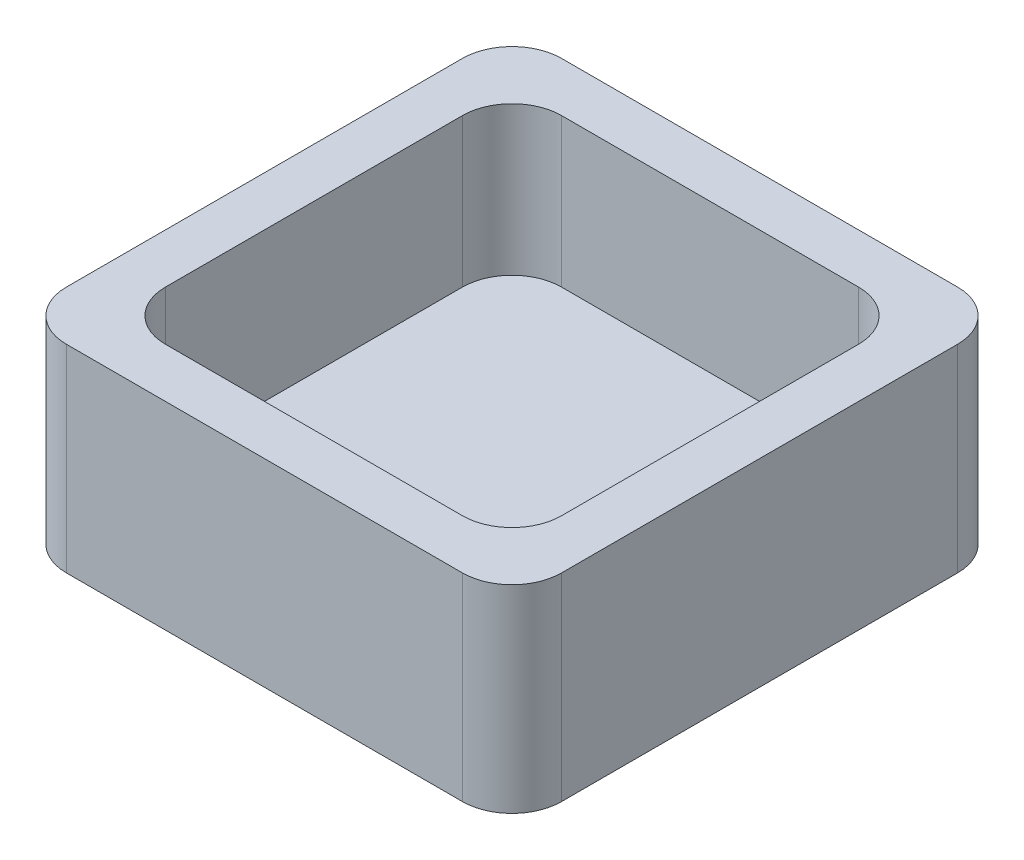
ISO-10303-21;
HEADER;
FILE_DESCRIPTION(('STEP AP214'),'2;1');
FILE_NAME('part.step','',(''),(''),'','','');
FILE_SCHEMA(('AUTOMOTIVE_DESIGN { 1 0 10303 214 1 1 1 1 }'));
ENDSEC;
DATA;
#1=APPLICATION_CONTEXT('core data for automotive mechanical design processes');
#2=APPLICATION_PROTOCOL_DEFINITION('international standard','automotive_design',2000,#1);
#3=PRODUCT_CONTEXT('',#1,'mechanical');
#4=PRODUCT('Part','Part','',(#3));
#5=PRODUCT_RELATED_PRODUCT_CATEGORY('part','',(#4));
#6=PRODUCT_DEFINITION_FORMATION('','',#4);
#7=PRODUCT_DEFINITION_CONTEXT('part definition',#1,'design');
#8=PRODUCT_DEFINITION('design','',#6,#7);
#9=PRODUCT_DEFINITION_SHAPE('','',#8);
#10=(LENGTH_UNIT() NAMED_UNIT(*) SI_UNIT(.MILLI.,.METRE.));
#11=(NAMED_UNIT(*) PLANE_ANGLE_UNIT() SI_UNIT($,.RADIAN.));
#12=(NAMED_UNIT(*) SI_UNIT($,.STERADIAN.) SOLID_ANGLE_UNIT());
#13=UNCERTAINTY_MEASURE_WITH_UNIT(LENGTH_MEASURE(1.E-05),#10,'distance_accuracy_value','');
#14=(GEOMETRIC_REPRESENTATION_CONTEXT(3) GLOBAL_UNCERTAINTY_ASSIGNED_CONTEXT((#13)) GLOBAL_UNIT_ASSIGNED_CONTEXT((#10,
#11,#12)) REPRESENTATION_CONTEXT('',''));
#15=CARTESIAN_POINT('',(0.,0.,0.));
#16=DIRECTION('',(0.,0.,1.));
#17=DIRECTION('',(1.,0.,0.));
#18=AXIS2_PLACEMENT_3D('',#15,#16,#17);
#19=CARTESIAN_POINT('',(-50.,40.,-50.));
#20=DIRECTION('',(1.,0.,0.));
#21=DIRECTION('',(0.,0.,-1.));
#22=AXIS2_PLACEMENT_3D('',#19,#20,#21);
#23=PLANE('',#22);
#24=DIRECTION('',(0.,0.,1.));
#25=VECTOR('',#24,1.);
#26=CARTESIAN_POINT('',(-50.,40.,-50.));
#27=LINE('',#26,#25);
#28=CARTESIAN_POINT('',(-50.,40.,-40.));
#29=VERTEX_POINT('',#28);
#30=CARTESIAN_POINT('',(-50.,40.,40.));
#31=VERTEX_POINT('',#30);
#32=EDGE_CURVE('E244',#29,#31,#27,.T.);
#33=ORIENTED_EDGE('',*,*,#32,.F.);
#34=DIRECTION('',(0.,-1.,0.));
#35=VECTOR('',#34,1.);
#36=CARTESIAN_POINT('',(-50.,40.,-40.));
#37=LINE('',#36,#35);
#38=CARTESIAN_POINT('',(-50.,0.,-40.));
#39=VERTEX_POINT('',#38);
#40=EDGE_CURVE('E287',#29,#39,#37,.T.);
#41=ORIENTED_EDGE('',*,*,#40,.T.);
#42=DIRECTION('',(0.,0.,1.));
#43=VECTOR('',#42,1.);
#44=CARTESIAN_POINT('',(-50.,0.,-50.));
#45=LINE('',#44,#43);
#46=CARTESIAN_POINT('',(-50.,0.,40.));
#47=VERTEX_POINT('',#46);
#48=EDGE_CURVE('E246',#39,#47,#45,.T.);
#49=ORIENTED_EDGE('',*,*,#48,.T.);
#50=DIRECTION('',(0.,-1.,0.));
#51=VECTOR('',#50,1.);
#52=CARTESIAN_POINT('',(-50.,40.,40.));
#53=LINE('',#52,#51);
#54=EDGE_CURVE('E284',#47,#31,#53,.F.);
#55=ORIENTED_EDGE('',*,*,#54,.T.);
#56=EDGE_LOOP('',(#33,#41,#49,#55));
#57=FACE_BOUND('',#56,.T.);
#58=ADVANCED_FACE('F45',(#57),#23,.F.);
#59=CARTESIAN_POINT('',(50.,40.,50.));
#60=DIRECTION('',(0.,0.,-1.));
#61=DIRECTION('',(-1.,0.,0.));
#62=AXIS2_PLACEMENT_3D('',#59,#60,#61);
#63=PLANE('',#62);
#64=DIRECTION('',(1.,0.,0.));
#65=VECTOR('',#64,1.);
#66=CARTESIAN_POINT('',(50.,0.,50.));
#67=LINE('',#66,#65);
#68=CARTESIAN_POINT('',(-40.,0.,50.));
#69=VERTEX_POINT('',#68);
#70=CARTESIAN_POINT('',(40.,0.,50.));
#71=VERTEX_POINT('',#70);
#72=EDGE_CURVE('E239',#69,#71,#67,.T.);
#73=ORIENTED_EDGE('',*,*,#72,.T.);
#74=DIRECTION('',(0.,-1.,0.));
#75=VECTOR('',#74,1.);
#76=CARTESIAN_POINT('',(40.,40.,50.));
#77=LINE('',#76,#75);
#78=CARTESIAN_POINT('',(40.,40.,50.));
#79=VERTEX_POINT('',#78);
#80=EDGE_CURVE('E214',#71,#79,#77,.F.);
#81=ORIENTED_EDGE('',*,*,#80,.T.);
#82=DIRECTION('',(1.,0.,0.));
#83=VECTOR('',#82,1.);
#84=CARTESIAN_POINT('',(50.,40.,50.));
#85=LINE('',#84,#83);
#86=CARTESIAN_POINT('',(-40.,40.,50.));
#87=VERTEX_POINT('',#86);
#88=EDGE_CURVE('E460',#87,#79,#85,.T.);
#89=ORIENTED_EDGE('',*,*,#88,.F.);
#90=DIRECTION('',(0.,-1.,0.));
#91=VECTOR('',#90,1.);
#92=CARTESIAN_POINT('',(-40.,40.,50.));
#93=LINE('',#92,#91);
#94=EDGE_CURVE('E220',#87,#69,#93,.T.);
#95=ORIENTED_EDGE('',*,*,#94,.T.);
#96=EDGE_LOOP('',(#73,#81,#89,#95));
#97=FACE_BOUND('',#96,.T.);
#98=ADVANCED_FACE('F483',(#97),#63,.F.);
#99=CARTESIAN_POINT('',(50.,40.,-50.));
#100=DIRECTION('',(-1.,0.,0.));
#101=DIRECTION('',(0.,0.,1.));
#102=AXIS2_PLACEMENT_3D('',#99,#100,#101);
#103=PLANE('',#102);
#104=DIRECTION('',(0.,0.,-1.));
#105=VECTOR('',#104,1.);
#106=CARTESIAN_POINT('',(50.,40.,-50.));
#107=LINE('',#106,#105);
#108=CARTESIAN_POINT('',(50.,40.,40.));
#109=VERTEX_POINT('',#108);
#110=CARTESIAN_POINT('',(50.,40.,-40.));
#111=VERTEX_POINT('',#110);
#112=EDGE_CURVE('E230',#109,#111,#107,.T.);
#113=ORIENTED_EDGE('',*,*,#112,.F.);
#114=DIRECTION('',(0.,-1.,0.));
#115=VECTOR('',#114,1.);
#116=CARTESIAN_POINT('',(50.,40.,40.));
#117=LINE('',#116,#115);
#118=CARTESIAN_POINT('',(50.,0.,40.));
#119=VERTEX_POINT('',#118);
#120=EDGE_CURVE('E213',#109,#119,#117,.T.);
#121=ORIENTED_EDGE('',*,*,#120,.T.);
#122=DIRECTION('',(0.,0.,-1.));
#123=VECTOR('',#122,1.);
#124=CARTESIAN_POINT('',(50.,0.,-50.));
#125=LINE('',#124,#123);
#126=CARTESIAN_POINT('',(50.,0.,-40.));
#127=VERTEX_POINT('',#126);
#128=EDGE_CURVE('E227',#119,#127,#125,.T.);
#129=ORIENTED_EDGE('',*,*,#128,.T.);
#130=DIRECTION('',(0.,-1.,0.));
#131=VECTOR('',#130,1.);
#132=CARTESIAN_POINT('',(50.,40.,-40.));
#133=LINE('',#132,#131);
#134=EDGE_CURVE('E233',#127,#111,#133,.F.);
#135=ORIENTED_EDGE('',*,*,#134,.T.);
#136=EDGE_LOOP('',(#113,#121,#129,#135));
#137=FACE_BOUND('',#136,.T.);
#138=ADVANCED_FACE('F226',(#137),#103,.F.);
#139=CARTESIAN_POINT('',(50.,40.,-50.));
#140=DIRECTION('',(0.,0.,1.));
#141=DIRECTION('',(1.,0.,0.));
#142=AXIS2_PLACEMENT_3D('',#139,#140,#141);
#143=PLANE('',#142);
#144=DIRECTION('',(-1.,0.,0.));
#145=VECTOR('',#144,1.);
#146=CARTESIAN_POINT('',(50.,40.,-50.));
#147=LINE('',#146,#145);
#148=CARTESIAN_POINT('',(40.,40.,-50.));
#149=VERTEX_POINT('',#148);
#150=CARTESIAN_POINT('',(-40.,40.,-50.));
#151=VERTEX_POINT('',#150);
#152=EDGE_CURVE('E251',#149,#151,#147,.T.);
#153=ORIENTED_EDGE('',*,*,#152,.F.);
#154=DIRECTION('',(0.,-1.,0.));
#155=VECTOR('',#154,1.);
#156=CARTESIAN_POINT('',(40.,40.,-50.));
#157=LINE('',#156,#155);
#158=CARTESIAN_POINT('',(40.,0.,-50.));
#159=VERTEX_POINT('',#158);
#160=EDGE_CURVE('E280',#149,#159,#157,.T.);
#161=ORIENTED_EDGE('',*,*,#160,.T.);
#162=DIRECTION('',(-1.,0.,0.));
#163=VECTOR('',#162,1.);
#164=CARTESIAN_POINT('',(50.,0.,-50.));
#165=LINE('',#164,#163);
#166=CARTESIAN_POINT('',(-40.,0.,-50.));
#167=VERTEX_POINT('',#166);
#168=EDGE_CURVE('E238',#159,#167,#165,.T.);
#169=ORIENTED_EDGE('',*,*,#168,.T.);
#170=DIRECTION('',(0.,-1.,0.));
#171=VECTOR('',#170,1.);
#172=CARTESIAN_POINT('',(-40.,40.,-50.));
#173=LINE('',#172,#171);
#174=EDGE_CURVE('E277',#167,#151,#173,.F.);
#175=ORIENTED_EDGE('',*,*,#174,.T.);
#176=EDGE_LOOP('',(#153,#161,#169,#175));
#177=FACE_BOUND('',#176,.T.);
#178=ADVANCED_FACE('F490',(#177),#143,.F.);
#179=CARTESIAN_POINT('',(0.,40.,0.));
#180=DIRECTION('',(0.,-1.,0.));
#181=DIRECTION('',(0.,0.,-1.));
#182=AXIS2_PLACEMENT_3D('',#179,#180,#181);
#183=PLANE('',#182);
#184=DIRECTION('',(1.,0.,0.));
#185=VECTOR('',#184,1.);
#186=CARTESIAN_POINT('',(40.,40.,40.));
#187=LINE('',#186,#185);
#188=CARTESIAN_POINT('',(-30.,40.,40.));
#189=VERTEX_POINT('',#188);
#190=CARTESIAN_POINT('',(30.,40.,40.));
#191=VERTEX_POINT('',#190);
#192=EDGE_CURVE('E446',#189,#191,#187,.T.);
#193=ORIENTED_EDGE('',*,*,#192,.F.);
#194=CARTESIAN_POINT('',(-30.,40.,30.));
#195=DIRECTION('',(0.,-1.,0.));
#196=DIRECTION('',(0.,0.,-1.));
#197=AXIS2_PLACEMENT_3D('',#194,#195,#196);
#198=CIRCLE('',#197,10.);
#199=CARTESIAN_POINT('',(-40.,40.,30.));
#200=VERTEX_POINT('',#199);
#201=EDGE_CURVE('E340',#189,#200,#198,.T.);
#202=ORIENTED_EDGE('',*,*,#201,.T.);
#203=DIRECTION('',(0.,0.,1.));
#204=VECTOR('',#203,1.);
#205=CARTESIAN_POINT('',(-40.,40.,-40.));
#206=LINE('',#205,#204);
#207=CARTESIAN_POINT('',(-40.,40.,-30.));
#208=VERTEX_POINT('',#207);
#209=EDGE_CURVE('E425',#208,#200,#206,.T.);
#210=ORIENTED_EDGE('',*,*,#209,.F.);
#211=CARTESIAN_POINT('',(-30.,40.,-30.));
#212=DIRECTION('',(0.,-1.,0.));
#213=DIRECTION('',(0.,0.,-1.));
#214=AXIS2_PLACEMENT_3D('',#211,#212,#213);
#215=CIRCLE('',#214,10.);
#216=CARTESIAN_POINT('',(-30.,40.,-40.));
#217=VERTEX_POINT('',#216);
#218=EDGE_CURVE('E337',#208,#217,#215,.T.);
#219=ORIENTED_EDGE('',*,*,#218,.T.);
#220=DIRECTION('',(-1.,0.,0.));
#221=VECTOR('',#220,1.);
#222=CARTESIAN_POINT('',(40.,40.,-40.));
#223=LINE('',#222,#221);
#224=CARTESIAN_POINT('',(30.,40.,-40.));
#225=VERTEX_POINT('',#224);
#226=EDGE_CURVE('E431',#225,#217,#223,.T.);
#227=ORIENTED_EDGE('',*,*,#226,.F.);
#228=CARTESIAN_POINT('',(30.,40.,-30.));
#229=DIRECTION('',(0.,-1.,0.));
#230=DIRECTION('',(0.,0.,-1.));
#231=AXIS2_PLACEMENT_3D('',#228,#229,#230);
#232=CIRCLE('',#231,10.);
#233=CARTESIAN_POINT('',(40.,40.,-30.));
#234=VERTEX_POINT('',#233);
#235=EDGE_CURVE('E334',#225,#234,#232,.T.);
#236=ORIENTED_EDGE('',*,*,#235,.T.);
#237=DIRECTION('',(0.,0.,-1.));
#238=VECTOR('',#237,1.);
#239=CARTESIAN_POINT('',(40.,40.,-40.));
#240=LINE('',#239,#238);
#241=CARTESIAN_POINT('',(40.,40.,30.));
#242=VERTEX_POINT('',#241);
#243=EDGE_CURVE('E450',#242,#234,#240,.T.);
#244=ORIENTED_EDGE('',*,*,#243,.F.);
#245=CARTESIAN_POINT('',(30.,40.,30.));
#246=DIRECTION('',(0.,-1.,0.));
#247=DIRECTION('',(0.,0.,-1.));
#248=AXIS2_PLACEMENT_3D('',#245,#246,#247);
#249=CIRCLE('',#248,10.);
#250=EDGE_CURVE('E331',#242,#191,#249,.T.);
#251=ORIENTED_EDGE('',*,*,#250,.T.);
#252=EDGE_LOOP('',(#193,#202,#210,#219,#227,#236,#244,#251));
#253=FACE_BOUND('',#252,.T.);
#254=ORIENTED_EDGE('',*,*,#88,.T.);
#255=CARTESIAN_POINT('',(40.,40.,40.));
#256=DIRECTION('',(0.,-1.,0.));
#257=DIRECTION('',(0.,0.,-1.));
#258=AXIS2_PLACEMENT_3D('',#255,#256,#257);
#259=CIRCLE('',#258,10.);
#260=EDGE_CURVE('E274',#79,#109,#259,.F.);
#261=ORIENTED_EDGE('',*,*,#260,.T.);
#262=ORIENTED_EDGE('',*,*,#112,.T.);
#263=CARTESIAN_POINT('',(40.,40.,-40.));
#264=DIRECTION('',(0.,-1.,0.));
#265=DIRECTION('',(0.,0.,-1.));
#266=AXIS2_PLACEMENT_3D('',#263,#264,#265);
#267=CIRCLE('',#266,10.);
#268=EDGE_CURVE('E271',#111,#149,#267,.F.);
#269=ORIENTED_EDGE('',*,*,#268,.T.);
#270=ORIENTED_EDGE('',*,*,#152,.T.);
#271=CARTESIAN_POINT('',(-40.,40.,-40.));
#272=DIRECTION('',(0.,-1.,0.));
#273=DIRECTION('',(0.,0.,-1.));
#274=AXIS2_PLACEMENT_3D('',#271,#272,#273);
#275=CIRCLE('',#274,10.);
#276=EDGE_CURVE('E268',#151,#29,#275,.F.);
#277=ORIENTED_EDGE('',*,*,#276,.T.);
#278=ORIENTED_EDGE('',*,*,#32,.T.);
#279=CARTESIAN_POINT('',(-40.,40.,40.));
#280=DIRECTION('',(0.,-1.,0.));
#281=DIRECTION('',(0.,0.,-1.));
#282=AXIS2_PLACEMENT_3D('',#279,#280,#281);
#283=CIRCLE('',#282,10.);
#284=EDGE_CURVE('E265',#31,#87,#283,.F.);
#285=ORIENTED_EDGE('',*,*,#284,.T.);
#286=EDGE_LOOP('',(#254,#261,#262,#269,#270,#277,#278,#285));
#287=FACE_BOUND('',#286,.T.);
#288=ADVANCED_FACE('F481',(#253,#287),#183,.F.);
#289=CARTESIAN_POINT('',(0.,0.,0.));
#290=DIRECTION('',(0.,-1.,0.));
#291=DIRECTION('',(0.,0.,-1.));
#292=AXIS2_PLACEMENT_3D('',#289,#290,#291);
#293=PLANE('',#292);
#294=DIRECTION('',(0.,0.,-1.));
#295=VECTOR('',#294,1.);
#296=CARTESIAN_POINT('',(-46.7082039324994,0.,33.));
#297=LINE('',#296,#295);
#298=CARTESIAN_POINT('',(-46.7082039324994,0.,-33.));
#299=VERTEX_POINT('',#298);
#300=CARTESIAN_POINT('',(-46.7082039324994,0.,33.));
#301=VERTEX_POINT('',#300);
#302=EDGE_CURVE('E356',#299,#301,#297,.F.);
#303=ORIENTED_EDGE('',*,*,#302,.T.);
#304=CARTESIAN_POINT('',(-33.,0.,33.));
#305=DIRECTION('',(0.,-1.,0.));
#306=DIRECTION('',(0.,0.,-1.));
#307=AXIS2_PLACEMENT_3D('',#304,#305,#306);
#308=CIRCLE('',#307,13.7082039324994);
#309=CARTESIAN_POINT('',(-33.,0.,46.7082039324994));
#310=VERTEX_POINT('',#309);
#311=EDGE_CURVE('E11',#301,#310,#308,.F.);
#312=ORIENTED_EDGE('',*,*,#311,.T.);
#313=DIRECTION('',(-1.,0.,0.));
#314=VECTOR('',#313,1.);
#315=CARTESIAN_POINT('',(33.,0.,46.7082039324994));
#316=LINE('',#315,#314);
#317=CARTESIAN_POINT('',(33.,0.,46.7082039324994));
#318=VERTEX_POINT('',#317);
#319=EDGE_CURVE('E55',#310,#318,#316,.F.);
#320=ORIENTED_EDGE('',*,*,#319,.T.);
#321=CARTESIAN_POINT('',(33.,0.,33.));
#322=DIRECTION('',(0.,-1.,0.));
#323=DIRECTION('',(0.,0.,-1.));
#324=AXIS2_PLACEMENT_3D('',#321,#322,#323);
#325=CIRCLE('',#324,13.7082039324994);
#326=CARTESIAN_POINT('',(46.7082039324994,0.,33.));
#327=VERTEX_POINT('',#326);
#328=EDGE_CURVE('E371',#318,#327,#325,.F.);
#329=ORIENTED_EDGE('',*,*,#328,.T.);
#330=DIRECTION('',(0.,0.,1.));
#331=VECTOR('',#330,1.);
#332=CARTESIAN_POINT('',(46.7082039324994,0.,-33.));
#333=LINE('',#332,#331);
#334=CARTESIAN_POINT('',(46.7082039324994,0.,-33.));
#335=VERTEX_POINT('',#334);
#336=EDGE_CURVE('E368',#327,#335,#333,.F.);
#337=ORIENTED_EDGE('',*,*,#336,.T.);
#338=CARTESIAN_POINT('',(33.,0.,-33.));
#339=DIRECTION('',(0.,-1.,0.));
#340=DIRECTION('',(0.,0.,-1.));
#341=AXIS2_PLACEMENT_3D('',#338,#339,#340);
#342=CIRCLE('',#341,13.7082039324994);
#343=CARTESIAN_POINT('',(33.,0.,-46.7082039324994));
#344=VERTEX_POINT('',#343);
#345=EDGE_CURVE('E365',#335,#344,#342,.F.);
#346=ORIENTED_EDGE('',*,*,#345,.T.);
#347=DIRECTION('',(1.,0.,0.));
#348=VECTOR('',#347,1.);
#349=CARTESIAN_POINT('',(-33.,0.,-46.7082039324994));
#350=LINE('',#349,#348);
#351=CARTESIAN_POINT('',(-33.,0.,-46.7082039324994));
#352=VERTEX_POINT('',#351);
#353=EDGE_CURVE('E362',#344,#352,#350,.F.);
#354=ORIENTED_EDGE('',*,*,#353,.T.);
#355=CARTESIAN_POINT('',(-33.,0.,-33.));
#356=DIRECTION('',(0.,-1.,0.));
#357=DIRECTION('',(0.,0.,-1.));
#358=AXIS2_PLACEMENT_3D('',#355,#356,#357);
#359=CIRCLE('',#358,13.7082039324994);
#360=EDGE_CURVE('E359',#352,#299,#359,.F.);
#361=ORIENTED_EDGE('',*,*,#360,.T.);
#362=EDGE_LOOP('',(#303,#312,#320,#329,#337,#346,#354,#361));
#363=FACE_BOUND('',#362,.T.);
#364=ORIENTED_EDGE('',*,*,#128,.F.);
#365=CARTESIAN_POINT('',(40.,0.,40.));
#366=DIRECTION('',(0.,-1.,0.));
#367=DIRECTION('',(0.,0.,-1.));
#368=AXIS2_PLACEMENT_3D('',#365,#366,#367);
#369=CIRCLE('',#368,10.);
#370=EDGE_CURVE('E209',#119,#71,#369,.T.);
#371=ORIENTED_EDGE('',*,*,#370,.T.);
#372=ORIENTED_EDGE('',*,*,#72,.F.);
#373=CARTESIAN_POINT('',(-40.,0.,40.));
#374=DIRECTION('',(0.,-1.,0.));
#375=DIRECTION('',(0.,0.,-1.));
#376=AXIS2_PLACEMENT_3D('',#373,#374,#375);
#377=CIRCLE('',#376,10.);
#378=EDGE_CURVE('E232',#69,#47,#377,.T.);
#379=ORIENTED_EDGE('',*,*,#378,.T.);
#380=ORIENTED_EDGE('',*,*,#48,.F.);
#381=CARTESIAN_POINT('',(-40.,0.,-40.));
#382=DIRECTION('',(0.,-1.,0.));
#383=DIRECTION('',(0.,0.,-1.));
#384=AXIS2_PLACEMENT_3D('',#381,#382,#383);
#385=CIRCLE('',#384,10.);
#386=EDGE_CURVE('E255',#39,#167,#385,.T.);
#387=ORIENTED_EDGE('',*,*,#386,.T.);
#388=ORIENTED_EDGE('',*,*,#168,.F.);
#389=CARTESIAN_POINT('',(40.,0.,-40.));
#390=DIRECTION('',(0.,-1.,0.));
#391=DIRECTION('',(0.,0.,-1.));
#392=AXIS2_PLACEMENT_3D('',#389,#390,#391);
#393=CIRCLE('',#392,10.);
#394=EDGE_CURVE('E221',#159,#127,#393,.T.);
#395=ORIENTED_EDGE('',*,*,#394,.T.);
#396=EDGE_LOOP('',(#364,#371,#372,#379,#380,#387,#388,#395));
#397=FACE_BOUND('',#396,.T.);
#398=ADVANCED_FACE('F235',(#363,#397),#293,.T.);
#399=CARTESIAN_POINT('',(-40.,10.,-40.));
#400=DIRECTION('',(-1.,0.,0.));
#401=DIRECTION('',(0.,0.,1.));
#402=AXIS2_PLACEMENT_3D('',#399,#400,#401);
#403=PLANE('',#402);
#404=DIRECTION('',(0.,0.,1.));
#405=VECTOR('',#404,1.);
#406=CARTESIAN_POINT('',(-40.,10.,-40.));
#407=LINE('',#406,#405);
#408=CARTESIAN_POINT('',(-40.,10.,-30.));
#409=VERTEX_POINT('',#408);
#410=CARTESIAN_POINT('',(-40.,10.,30.));
#411=VERTEX_POINT('',#410);
#412=EDGE_CURVE('E426',#409,#411,#407,.T.);
#413=ORIENTED_EDGE('',*,*,#412,.F.);
#414=DIRECTION('',(0.,1.,0.));
#415=VECTOR('',#414,1.);
#416=CARTESIAN_POINT('',(-40.,40.,-30.));
#417=LINE('',#416,#415);
#418=EDGE_CURVE('E327',#409,#208,#417,.T.);
#419=ORIENTED_EDGE('',*,*,#418,.T.);
#420=ORIENTED_EDGE('',*,*,#209,.T.);
#421=DIRECTION('',(0.,1.,0.));
#422=VECTOR('',#421,1.);
#423=CARTESIAN_POINT('',(-40.,10.,30.));
#424=LINE('',#423,#422);
#425=EDGE_CURVE('E324',#200,#411,#424,.F.);
#426=ORIENTED_EDGE('',*,*,#425,.T.);
#427=EDGE_LOOP('',(#413,#419,#420,#426));
#428=FACE_BOUND('',#427,.T.);
#429=ADVANCED_FACE('F565',(#428),#403,.F.);
#430=CARTESIAN_POINT('',(40.,10.,-40.));
#431=DIRECTION('',(0.,0.,-1.));
#432=DIRECTION('',(-1.,0.,0.));
#433=AXIS2_PLACEMENT_3D('',#430,#431,#432);
#434=PLANE('',#433);
#435=DIRECTION('',(-1.,0.,0.));
#436=VECTOR('',#435,1.);
#437=CARTESIAN_POINT('',(40.,10.,-40.));
#438=LINE('',#437,#436);
#439=CARTESIAN_POINT('',(30.,10.,-40.));
#440=VERTEX_POINT('',#439);
#441=CARTESIAN_POINT('',(-30.,10.,-40.));
#442=VERTEX_POINT('',#441);
#443=EDGE_CURVE('E439',#440,#442,#438,.T.);
#444=ORIENTED_EDGE('',*,*,#443,.F.);
#445=DIRECTION('',(0.,1.,0.));
#446=VECTOR('',#445,1.);
#447=CARTESIAN_POINT('',(30.,40.,-40.));
#448=LINE('',#447,#446);
#449=EDGE_CURVE('E320',#440,#225,#448,.T.);
#450=ORIENTED_EDGE('',*,*,#449,.T.);
#451=ORIENTED_EDGE('',*,*,#226,.T.);
#452=DIRECTION('',(0.,1.,0.));
#453=VECTOR('',#452,1.);
#454=CARTESIAN_POINT('',(-30.,10.,-40.));
#455=LINE('',#454,#453);
#456=EDGE_CURVE('E317',#217,#442,#455,.F.);
#457=ORIENTED_EDGE('',*,*,#456,.T.);
#458=EDGE_LOOP('',(#444,#450,#451,#457));
#459=FACE_BOUND('',#458,.T.);
#460=ADVANCED_FACE('F571',(#459),#434,.F.);
#461=CARTESIAN_POINT('',(40.,10.,-40.));
#462=DIRECTION('',(1.,0.,0.));
#463=DIRECTION('',(0.,0.,-1.));
#464=AXIS2_PLACEMENT_3D('',#461,#462,#463);
#465=PLANE('',#464);
#466=DIRECTION('',(0.,0.,-1.));
#467=VECTOR('',#466,1.);
#468=CARTESIAN_POINT('',(40.,10.,-40.));
#469=LINE('',#468,#467);
#470=CARTESIAN_POINT('',(40.,10.,30.));
#471=VERTEX_POINT('',#470);
#472=CARTESIAN_POINT('',(40.,10.,-30.));
#473=VERTEX_POINT('',#472);
#474=EDGE_CURVE('E435',#471,#473,#469,.T.);
#475=ORIENTED_EDGE('',*,*,#474,.F.);
#476=DIRECTION('',(0.,1.,0.));
#477=VECTOR('',#476,1.);
#478=CARTESIAN_POINT('',(40.,40.,30.));
#479=LINE('',#478,#477);
#480=EDGE_CURVE('E294',#471,#242,#479,.T.);
#481=ORIENTED_EDGE('',*,*,#480,.T.);
#482=ORIENTED_EDGE('',*,*,#243,.T.);
#483=DIRECTION('',(0.,1.,0.));
#484=VECTOR('',#483,1.);
#485=CARTESIAN_POINT('',(40.,10.,-30.));
#486=LINE('',#485,#484);
#487=EDGE_CURVE('E291',#234,#473,#486,.F.);
#488=ORIENTED_EDGE('',*,*,#487,.T.);
#489=EDGE_LOOP('',(#475,#481,#482,#488));
#490=FACE_BOUND('',#489,.T.);
#491=ADVANCED_FACE('F609',(#490),#465,.F.);
#492=CARTESIAN_POINT('',(40.,10.,40.));
#493=DIRECTION('',(0.,0.,1.));
#494=DIRECTION('',(1.,0.,0.));
#495=AXIS2_PLACEMENT_3D('',#492,#493,#494);
#496=PLANE('',#495);
#497=ORIENTED_EDGE('',*,*,#192,.T.);
#498=DIRECTION('',(0.,1.,0.));
#499=VECTOR('',#498,1.);
#500=CARTESIAN_POINT('',(30.,10.,40.));
#501=LINE('',#500,#499);
#502=CARTESIAN_POINT('',(30.,10.,40.));
#503=VERTEX_POINT('',#502);
#504=EDGE_CURVE('E302',#191,#503,#501,.F.);
#505=ORIENTED_EDGE('',*,*,#504,.T.);
#506=DIRECTION('',(1.,0.,0.));
#507=VECTOR('',#506,1.);
#508=CARTESIAN_POINT('',(40.,10.,40.));
#509=LINE('',#508,#507);
#510=CARTESIAN_POINT('',(-30.,10.,40.));
#511=VERTEX_POINT('',#510);
#512=EDGE_CURVE('E430',#511,#503,#509,.T.);
#513=ORIENTED_EDGE('',*,*,#512,.F.);
#514=DIRECTION('',(0.,1.,0.));
#515=VECTOR('',#514,1.);
#516=CARTESIAN_POINT('',(-30.,40.,40.));
#517=LINE('',#516,#515);
#518=EDGE_CURVE('E298',#511,#189,#517,.T.);
#519=ORIENTED_EDGE('',*,*,#518,.T.);
#520=EDGE_LOOP('',(#497,#505,#513,#519));
#521=FACE_BOUND('',#520,.T.);
#522=ADVANCED_FACE('F620',(#521),#496,.F.);
#523=CARTESIAN_POINT('',(0.,10.,0.));
#524=DIRECTION('',(0.,-1.,0.));
#525=DIRECTION('',(0.,0.,-1.));
#526=AXIS2_PLACEMENT_3D('',#523,#524,#525);
#527=PLANE('',#526);
#528=ORIENTED_EDGE('',*,*,#512,.T.);
#529=CARTESIAN_POINT('',(30.,10.,30.));
#530=DIRECTION('',(0.,-1.,0.));
#531=DIRECTION('',(0.,0.,-1.));
#532=AXIS2_PLACEMENT_3D('',#529,#530,#531);
#533=CIRCLE('',#532,10.);
#534=EDGE_CURVE('E314',#503,#471,#533,.F.);
#535=ORIENTED_EDGE('',*,*,#534,.T.);
#536=ORIENTED_EDGE('',*,*,#474,.T.);
#537=CARTESIAN_POINT('',(30.,10.,-30.));
#538=DIRECTION('',(0.,-1.,0.));
#539=DIRECTION('',(0.,0.,-1.));
#540=AXIS2_PLACEMENT_3D('',#537,#538,#539);
#541=CIRCLE('',#540,10.);
#542=EDGE_CURVE('E311',#473,#440,#541,.F.);
#543=ORIENTED_EDGE('',*,*,#542,.T.);
#544=ORIENTED_EDGE('',*,*,#443,.T.);
#545=CARTESIAN_POINT('',(-30.,10.,-30.));
#546=DIRECTION('',(0.,-1.,0.));
#547=DIRECTION('',(0.,0.,-1.));
#548=AXIS2_PLACEMENT_3D('',#545,#546,#547);
#549=CIRCLE('',#548,10.);
#550=EDGE_CURVE('E308',#442,#409,#549,.F.);
#551=ORIENTED_EDGE('',*,*,#550,.T.);
#552=ORIENTED_EDGE('',*,*,#412,.T.);
#553=CARTESIAN_POINT('',(-30.,10.,30.));
#554=DIRECTION('',(0.,-1.,0.));
#555=DIRECTION('',(0.,0.,-1.));
#556=AXIS2_PLACEMENT_3D('',#553,#554,#555);
#557=CIRCLE('',#556,10.);
#558=EDGE_CURVE('E305',#411,#511,#557,.F.);
#559=ORIENTED_EDGE('',*,*,#558,.T.);
#560=EDGE_LOOP('',(#528,#535,#536,#543,#544,#551,#552,#559));
#561=FACE_BOUND('',#560,.T.);
#562=ADVANCED_FACE('F631',(#561),#527,.F.);
#563=CARTESIAN_POINT('',(0.,-5.,0.));
#564=DIRECTION('',(0.,1.,0.));
#565=DIRECTION('',(0.,0.,1.));
#566=AXIS2_PLACEMENT_3D('',#563,#564,#565);
#567=PLANE('',#566);
#568=DIRECTION('',(1.,0.,0.));
#569=VECTOR('',#568,1.);
#570=CARTESIAN_POINT('',(40.,-5.,-40.));
#571=LINE('',#570,#569);
#572=CARTESIAN_POINT('',(-33.,-5.,-40.));
#573=VERTEX_POINT('',#572);
#574=CARTESIAN_POINT('',(33.,-5.,-40.));
#575=VERTEX_POINT('',#574);
#576=EDGE_CURVE('E411',#573,#575,#571,.T.);
#577=ORIENTED_EDGE('',*,*,#576,.T.);
#578=CARTESIAN_POINT('',(33.,-5.,-33.));
#579=DIRECTION('',(0.,1.,0.));
#580=DIRECTION('',(0.,0.,1.));
#581=AXIS2_PLACEMENT_3D('',#578,#579,#580);
#582=CIRCLE('',#581,7.);
#583=CARTESIAN_POINT('',(40.,-5.,-33.));
#584=VERTEX_POINT('',#583);
#585=EDGE_CURVE('E353',#575,#584,#582,.F.);
#586=ORIENTED_EDGE('',*,*,#585,.T.);
#587=DIRECTION('',(0.,0.,1.));
#588=VECTOR('',#587,1.);
#589=CARTESIAN_POINT('',(40.,-5.,40.));
#590=LINE('',#589,#588);
#591=CARTESIAN_POINT('',(40.,-5.,33.));
#592=VERTEX_POINT('',#591);
#593=EDGE_CURVE('E417',#584,#592,#590,.T.);
#594=ORIENTED_EDGE('',*,*,#593,.T.);
#595=CARTESIAN_POINT('',(33.,-5.,33.));
#596=DIRECTION('',(0.,1.,0.));
#597=DIRECTION('',(0.,0.,1.));
#598=AXIS2_PLACEMENT_3D('',#595,#596,#597);
#599=CIRCLE('',#598,7.);
#600=CARTESIAN_POINT('',(33.,-5.,40.));
#601=VERTEX_POINT('',#600);
#602=EDGE_CURVE('E350',#592,#601,#599,.F.);
#603=ORIENTED_EDGE('',*,*,#602,.T.);
#604=DIRECTION('',(-1.,0.,0.));
#605=VECTOR('',#604,1.);
#606=CARTESIAN_POINT('',(40.,-5.,40.));
#607=LINE('',#606,#605);
#608=CARTESIAN_POINT('',(-33.,-5.,40.));
#609=VERTEX_POINT('',#608);
#610=EDGE_CURVE('E422',#601,#609,#607,.T.);
#611=ORIENTED_EDGE('',*,*,#610,.T.);
#612=CARTESIAN_POINT('',(-33.,-5.,33.));
#613=DIRECTION('',(0.,1.,0.));
#614=DIRECTION('',(0.,0.,1.));
#615=AXIS2_PLACEMENT_3D('',#612,#613,#614);
#616=CIRCLE('',#615,7.);
#617=CARTESIAN_POINT('',(-40.,-5.,33.));
#618=VERTEX_POINT('',#617);
#619=EDGE_CURVE('E346',#609,#618,#616,.F.);
#620=ORIENTED_EDGE('',*,*,#619,.T.);
#621=DIRECTION('',(0.,0.,-1.));
#622=VECTOR('',#621,1.);
#623=CARTESIAN_POINT('',(-40.,-5.,40.));
#624=LINE('',#623,#622);
#625=CARTESIAN_POINT('',(-40.,-5.,-33.));
#626=VERTEX_POINT('',#625);
#627=EDGE_CURVE('E405',#618,#626,#624,.T.);
#628=ORIENTED_EDGE('',*,*,#627,.T.);
#629=CARTESIAN_POINT('',(-33.,-5.,-33.));
#630=DIRECTION('',(0.,1.,0.));
#631=DIRECTION('',(0.,0.,1.));
#632=AXIS2_PLACEMENT_3D('',#629,#630,#631);
#633=CIRCLE('',#632,7.);
#634=EDGE_CURVE('E343',#626,#573,#633,.F.);
#635=ORIENTED_EDGE('',*,*,#634,.T.);
#636=EDGE_LOOP('',(#577,#586,#594,#603,#611,#620,#628,#635));
#637=FACE_BOUND('',#636,.T.);
#638=ADVANCED_FACE('F498',(#637),#567,.F.);
#639=CARTESIAN_POINT('',(40.,40.,40.));
#640=DIRECTION('',(0.,-1.,0.));
#641=DIRECTION('',(0.,0.,-1.));
#642=AXIS2_PLACEMENT_3D('',#639,#640,#641);
#643=CYLINDRICAL_SURFACE('',#642,10.);
#644=ORIENTED_EDGE('',*,*,#260,.F.);
#645=ORIENTED_EDGE('',*,*,#80,.F.);
#646=ORIENTED_EDGE('',*,*,#370,.F.);
#647=ORIENTED_EDGE('',*,*,#120,.F.);
#648=EDGE_LOOP('',(#644,#645,#646,#647));
#649=FACE_BOUND('',#648,.T.);
#650=ADVANCED_FACE('F212',(#649),#643,.T.);
#651=CARTESIAN_POINT('',(40.,40.,-40.));
#652=DIRECTION('',(0.,-1.,0.));
#653=DIRECTION('',(0.,0.,-1.));
#654=AXIS2_PLACEMENT_3D('',#651,#652,#653);
#655=CYLINDRICAL_SURFACE('',#654,10.);
#656=ORIENTED_EDGE('',*,*,#268,.F.);
#657=ORIENTED_EDGE('',*,*,#134,.F.);
#658=ORIENTED_EDGE('',*,*,#394,.F.);
#659=ORIENTED_EDGE('',*,*,#160,.F.);
#660=EDGE_LOOP('',(#656,#657,#658,#659));
#661=FACE_BOUND('',#660,.T.);
#662=ADVANCED_FACE('F497',(#661),#655,.T.);
#663=CARTESIAN_POINT('',(-40.,40.,-40.));
#664=DIRECTION('',(0.,-1.,0.));
#665=DIRECTION('',(0.,0.,-1.));
#666=AXIS2_PLACEMENT_3D('',#663,#664,#665);
#667=CYLINDRICAL_SURFACE('',#666,10.);
#668=ORIENTED_EDGE('',*,*,#276,.F.);
#669=ORIENTED_EDGE('',*,*,#174,.F.);
#670=ORIENTED_EDGE('',*,*,#386,.F.);
#671=ORIENTED_EDGE('',*,*,#40,.F.);
#672=EDGE_LOOP('',(#668,#669,#670,#671));
#673=FACE_BOUND('',#672,.T.);
#674=ADVANCED_FACE('F501',(#673),#667,.T.);
#675=CARTESIAN_POINT('',(-40.,40.,40.));
#676=DIRECTION('',(0.,-1.,0.));
#677=DIRECTION('',(0.,0.,-1.));
#678=AXIS2_PLACEMENT_3D('',#675,#676,#677);
#679=CYLINDRICAL_SURFACE('',#678,10.);
#680=ORIENTED_EDGE('',*,*,#284,.F.);
#681=ORIENTED_EDGE('',*,*,#54,.F.);
#682=ORIENTED_EDGE('',*,*,#378,.F.);
#683=ORIENTED_EDGE('',*,*,#94,.F.);
#684=EDGE_LOOP('',(#680,#681,#682,#683));
#685=FACE_BOUND('',#684,.T.);
#686=ADVANCED_FACE('F477',(#685),#679,.T.);
#687=CARTESIAN_POINT('',(30.,10.,30.));
#688=DIRECTION('',(0.,-1.,0.));
#689=DIRECTION('',(0.,0.,-1.));
#690=AXIS2_PLACEMENT_3D('',#687,#688,#689);
#691=CYLINDRICAL_SURFACE('',#690,10.);
#692=ORIENTED_EDGE('',*,*,#534,.F.);
#693=ORIENTED_EDGE('',*,*,#504,.F.);
#694=ORIENTED_EDGE('',*,*,#250,.F.);
#695=ORIENTED_EDGE('',*,*,#480,.F.);
#696=EDGE_LOOP('',(#692,#693,#694,#695));
#697=FACE_BOUND('',#696,.T.);
#698=ADVANCED_FACE('F508',(#697),#691,.F.);
#699=CARTESIAN_POINT('',(30.,10.,-30.));
#700=DIRECTION('',(0.,-1.,0.));
#701=DIRECTION('',(0.,0.,-1.));
#702=AXIS2_PLACEMENT_3D('',#699,#700,#701);
#703=CYLINDRICAL_SURFACE('',#702,10.);
#704=ORIENTED_EDGE('',*,*,#542,.F.);
#705=ORIENTED_EDGE('',*,*,#487,.F.);
#706=ORIENTED_EDGE('',*,*,#235,.F.);
#707=ORIENTED_EDGE('',*,*,#449,.F.);
#708=EDGE_LOOP('',(#704,#705,#706,#707));
#709=FACE_BOUND('',#708,.T.);
#710=ADVANCED_FACE('F511',(#709),#703,.F.);
#711=CARTESIAN_POINT('',(-30.,10.,-30.));
#712=DIRECTION('',(0.,-1.,0.));
#713=DIRECTION('',(0.,0.,-1.));
#714=AXIS2_PLACEMENT_3D('',#711,#712,#713);
#715=CYLINDRICAL_SURFACE('',#714,10.);
#716=ORIENTED_EDGE('',*,*,#550,.F.);
#717=ORIENTED_EDGE('',*,*,#456,.F.);
#718=ORIENTED_EDGE('',*,*,#218,.F.);
#719=ORIENTED_EDGE('',*,*,#418,.F.);
#720=EDGE_LOOP('',(#716,#717,#718,#719));
#721=FACE_BOUND('',#720,.T.);
#722=ADVANCED_FACE('F515',(#721),#715,.F.);
#723=CARTESIAN_POINT('',(-30.,10.,30.));
#724=DIRECTION('',(0.,-1.,0.));
#725=DIRECTION('',(0.,0.,-1.));
#726=AXIS2_PLACEMENT_3D('',#723,#724,#725);
#727=CYLINDRICAL_SURFACE('',#726,10.);
#728=ORIENTED_EDGE('',*,*,#558,.F.);
#729=ORIENTED_EDGE('',*,*,#425,.F.);
#730=ORIENTED_EDGE('',*,*,#201,.F.);
#731=ORIENTED_EDGE('',*,*,#518,.F.);
#732=EDGE_LOOP('',(#728,#729,#730,#731));
#733=FACE_BOUND('',#732,.T.);
#734=ADVANCED_FACE('F519',(#733),#727,.F.);
#735=CARTESIAN_POINT('',(33.,-7.,-33.));
#736=DIRECTION('',(0.,-1.,0.));
#737=DIRECTION('',(0.,0.,-1.));
#738=AXIS2_PLACEMENT_3D('',#735,#736,#737);
#739=TOROIDAL_SURFACE('',#738,13.7082039324994,7.);
#740=CARTESIAN_POINT('',(46.7082039324994,-7.,-33.));
#741=DIRECTION('',(0.,0.,-1.));
#742=DIRECTION('',(-1.,0.,0.));
#743=AXIS2_PLACEMENT_3D('',#740,#741,#742);
#744=CIRCLE('',#743,7.);
#745=EDGE_CURVE('E396',#584,#335,#744,.T.);
#746=ORIENTED_EDGE('',*,*,#745,.F.);
#747=ORIENTED_EDGE('',*,*,#585,.F.);
#748=CARTESIAN_POINT('',(33.,-7.,-46.7082039324994));
#749=DIRECTION('',(1.,0.,0.));
#750=DIRECTION('',(0.,0.,-1.));
#751=AXIS2_PLACEMENT_3D('',#748,#749,#750);
#752=CIRCLE('',#751,7.);
#753=EDGE_CURVE('E49',#344,#575,#752,.T.);
#754=ORIENTED_EDGE('',*,*,#753,.F.);
#755=ORIENTED_EDGE('',*,*,#345,.F.);
#756=EDGE_LOOP('',(#746,#747,#754,#755));
#757=FACE_BOUND('',#756,.T.);
#758=ADVANCED_FACE('F47',(#757),#739,.F.);
#759=CARTESIAN_POINT('',(40.,-7.,-46.7082039324994));
#760=DIRECTION('',(-1.,0.,0.));
#761=DIRECTION('',(0.,0.,1.));
#762=AXIS2_PLACEMENT_3D('',#759,#760,#761);
#763=CYLINDRICAL_SURFACE('',#762,7.);
#764=ORIENTED_EDGE('',*,*,#753,.T.);
#765=ORIENTED_EDGE('',*,*,#576,.F.);
#766=CARTESIAN_POINT('',(-33.,-7.,-46.7082039324994));
#767=DIRECTION('',(1.,0.,0.));
#768=DIRECTION('',(0.,0.,-1.));
#769=AXIS2_PLACEMENT_3D('',#766,#767,#768);
#770=CIRCLE('',#769,7.);
#771=EDGE_CURVE('E393',#352,#573,#770,.T.);
#772=ORIENTED_EDGE('',*,*,#771,.F.);
#773=ORIENTED_EDGE('',*,*,#353,.F.);
#774=EDGE_LOOP('',(#764,#765,#772,#773));
#775=FACE_BOUND('',#774,.T.);
#776=ADVANCED_FACE('F545',(#775),#763,.F.);
#777=CARTESIAN_POINT('',(46.7082039324994,-7.,40.));
#778=DIRECTION('',(0.,0.,-1.));
#779=DIRECTION('',(-1.,0.,0.));
#780=AXIS2_PLACEMENT_3D('',#777,#778,#779);
#781=CYLINDRICAL_SURFACE('',#780,7.);
#782=ORIENTED_EDGE('',*,*,#745,.T.);
#783=ORIENTED_EDGE('',*,*,#336,.F.);
#784=CARTESIAN_POINT('',(46.7082039324994,-7.,33.));
#785=DIRECTION('',(0.,0.,-1.));
#786=DIRECTION('',(-1.,0.,0.));
#787=AXIS2_PLACEMENT_3D('',#784,#785,#786);
#788=CIRCLE('',#787,7.);
#789=EDGE_CURVE('E389',#592,#327,#788,.T.);
#790=ORIENTED_EDGE('',*,*,#789,.F.);
#791=ORIENTED_EDGE('',*,*,#593,.F.);
#792=EDGE_LOOP('',(#782,#783,#790,#791));
#793=FACE_BOUND('',#792,.T.);
#794=ADVANCED_FACE('F542',(#793),#781,.F.);
#795=CARTESIAN_POINT('',(-33.,-7.,-33.));
#796=DIRECTION('',(0.,-1.,0.));
#797=DIRECTION('',(0.,0.,-1.));
#798=AXIS2_PLACEMENT_3D('',#795,#796,#797);
#799=TOROIDAL_SURFACE('',#798,13.7082039324994,7.);
#800=ORIENTED_EDGE('',*,*,#771,.T.);
#801=ORIENTED_EDGE('',*,*,#634,.F.);
#802=CARTESIAN_POINT('',(-46.7082039324994,-7.,-33.));
#803=DIRECTION('',(0.,0.,-1.));
#804=DIRECTION('',(-1.,0.,0.));
#805=AXIS2_PLACEMENT_3D('',#802,#803,#804);
#806=CIRCLE('',#805,7.);
#807=EDGE_CURVE('E385',#299,#626,#806,.T.);
#808=ORIENTED_EDGE('',*,*,#807,.F.);
#809=ORIENTED_EDGE('',*,*,#360,.F.);
#810=EDGE_LOOP('',(#800,#801,#808,#809));
#811=FACE_BOUND('',#810,.T.);
#812=ADVANCED_FACE('F538',(#811),#799,.F.);
#813=CARTESIAN_POINT('',(33.,-7.,33.));
#814=DIRECTION('',(0.,-1.,0.));
#815=DIRECTION('',(0.,0.,-1.));
#816=AXIS2_PLACEMENT_3D('',#813,#814,#815);
#817=TOROIDAL_SURFACE('',#816,13.7082039324994,7.);
#818=ORIENTED_EDGE('',*,*,#789,.T.);
#819=ORIENTED_EDGE('',*,*,#328,.F.);
#820=CARTESIAN_POINT('',(33.,-7.,46.7082039324994));
#821=DIRECTION('',(1.,0.,0.));
#822=DIRECTION('',(0.,0.,-1.));
#823=AXIS2_PLACEMENT_3D('',#820,#821,#822);
#824=CIRCLE('',#823,7.);
#825=EDGE_CURVE('E381',#601,#318,#824,.T.);
#826=ORIENTED_EDGE('',*,*,#825,.F.);
#827=ORIENTED_EDGE('',*,*,#602,.F.);
#828=EDGE_LOOP('',(#818,#819,#826,#827));
#829=FACE_BOUND('',#828,.T.);
#830=ADVANCED_FACE('F534',(#829),#817,.F.);
#831=CARTESIAN_POINT('',(-46.7082039324994,-7.,40.));
#832=DIRECTION('',(0.,0.,1.));
#833=DIRECTION('',(1.,0.,0.));
#834=AXIS2_PLACEMENT_3D('',#831,#832,#833);
#835=CYLINDRICAL_SURFACE('',#834,7.);
#836=ORIENTED_EDGE('',*,*,#807,.T.);
#837=ORIENTED_EDGE('',*,*,#627,.F.);
#838=CARTESIAN_POINT('',(-46.7082039324994,-7.,33.));
#839=DIRECTION('',(0.,0.,-1.));
#840=DIRECTION('',(-1.,0.,0.));
#841=AXIS2_PLACEMENT_3D('',#838,#839,#840);
#842=CIRCLE('',#841,7.);
#843=EDGE_CURVE('E378',#301,#618,#842,.T.);
#844=ORIENTED_EDGE('',*,*,#843,.F.);
#845=ORIENTED_EDGE('',*,*,#302,.F.);
#846=EDGE_LOOP('',(#836,#837,#844,#845));
#847=FACE_BOUND('',#846,.T.);
#848=ADVANCED_FACE('F530',(#847),#835,.F.);
#849=CARTESIAN_POINT('',(40.,-7.,46.7082039324994));
#850=DIRECTION('',(1.,0.,0.));
#851=DIRECTION('',(0.,0.,-1.));
#852=AXIS2_PLACEMENT_3D('',#849,#850,#851);
#853=CYLINDRICAL_SURFACE('',#852,7.);
#854=ORIENTED_EDGE('',*,*,#825,.T.);
#855=ORIENTED_EDGE('',*,*,#319,.F.);
#856=CARTESIAN_POINT('',(-33.,-7.,46.7082039324994));
#857=DIRECTION('',(1.,0.,0.));
#858=DIRECTION('',(0.,0.,-1.));
#859=AXIS2_PLACEMENT_3D('',#856,#857,#858);
#860=CIRCLE('',#859,7.);
#861=EDGE_CURVE('E63',#609,#310,#860,.T.);
#862=ORIENTED_EDGE('',*,*,#861,.F.);
#863=ORIENTED_EDGE('',*,*,#610,.F.);
#864=EDGE_LOOP('',(#854,#855,#862,#863));
#865=FACE_BOUND('',#864,.T.);
#866=ADVANCED_FACE('F527',(#865),#853,.F.);
#867=CARTESIAN_POINT('',(-33.,-7.,33.));
#868=DIRECTION('',(0.,-1.,0.));
#869=DIRECTION('',(0.,0.,-1.));
#870=AXIS2_PLACEMENT_3D('',#867,#868,#869);
#871=TOROIDAL_SURFACE('',#870,13.7082039324994,7.);
#872=ORIENTED_EDGE('',*,*,#843,.T.);
#873=ORIENTED_EDGE('',*,*,#619,.F.);
#874=ORIENTED_EDGE('',*,*,#861,.T.);
#875=ORIENTED_EDGE('',*,*,#311,.F.);
#876=EDGE_LOOP('',(#872,#873,#874,#875));
#877=FACE_BOUND('',#876,.T.);
#878=ADVANCED_FACE('F524',(#877),#871,.F.);
#879=CLOSED_SHELL('',(#58,#98,#138,#178,#288,#398,#429,#460,#491,#522,#562,#638,#650,#662,#674,
#686,#698,#710,#722,#734,#758,#776,#794,#812,#830,#848,#866,#878));
#880=MANIFOLD_SOLID_BREP('B2',#879);
#881=ADVANCED_BREP_SHAPE_REPRESENTATION('',(#18,#880),#14);
#882=SHAPE_DEFINITION_REPRESENTATION(#9,#881);
ENDSEC;
END-ISO-10303-21;
